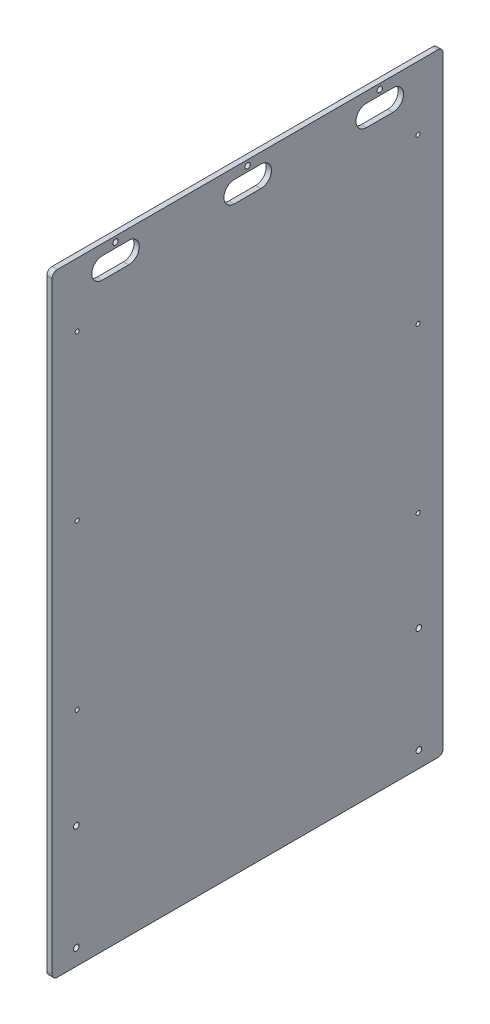
ISO-10303-21;
HEADER;
FILE_DESCRIPTION(('STEP AP214'),'2;1');
FILE_NAME('part.step','',(''),(''),'','','');
FILE_SCHEMA(('AUTOMOTIVE_DESIGN { 1 0 10303 214 1 1 1 1 }'));
ENDSEC;
DATA;
#1=APPLICATION_CONTEXT('core data for automotive mechanical design processes');
#2=APPLICATION_PROTOCOL_DEFINITION('international standard','automotive_design',2000,#1);
#3=PRODUCT_CONTEXT('',#1,'mechanical');
#4=PRODUCT('Part','Part','',(#3));
#5=PRODUCT_RELATED_PRODUCT_CATEGORY('part','',(#4));
#6=PRODUCT_DEFINITION_FORMATION('','',#4);
#7=PRODUCT_DEFINITION_CONTEXT('part definition',#1,'design');
#8=PRODUCT_DEFINITION('design','',#6,#7);
#9=PRODUCT_DEFINITION_SHAPE('','',#8);
#10=(LENGTH_UNIT() NAMED_UNIT(*) SI_UNIT(.MILLI.,.METRE.));
#11=(NAMED_UNIT(*) PLANE_ANGLE_UNIT() SI_UNIT($,.RADIAN.));
#12=(NAMED_UNIT(*) SI_UNIT($,.STERADIAN.) SOLID_ANGLE_UNIT());
#13=UNCERTAINTY_MEASURE_WITH_UNIT(LENGTH_MEASURE(1.E-05),#10,'distance_accuracy_value','');
#14=(GEOMETRIC_REPRESENTATION_CONTEXT(3) GLOBAL_UNCERTAINTY_ASSIGNED_CONTEXT((#13)) GLOBAL_UNIT_ASSIGNED_CONTEXT((#10,
#11,#12)) REPRESENTATION_CONTEXT('',''));
#15=CARTESIAN_POINT('',(0.,0.,0.));
#16=DIRECTION('',(0.,0.,1.));
#17=DIRECTION('',(1.,0.,0.));
#18=AXIS2_PLACEMENT_3D('',#15,#16,#17);
#19=CARTESIAN_POINT('',(0.,0.,0.));
#20=DIRECTION('',(-1.,0.,0.));
#21=DIRECTION('',(0.,0.,1.));
#22=AXIS2_PLACEMENT_3D('',#19,#20,#21);
#23=PLANE('',#22);
#24=CARTESIAN_POINT('',(0.,361.95,158.75));
#25=DIRECTION('',(1.,0.,0.));
#26=DIRECTION('',(0.,0.,-1.));
#27=AXIS2_PLACEMENT_3D('',#24,#25,#26);
#28=CIRCLE('',#27,3.17499999999998);
#29=CARTESIAN_POINT('',(0.,361.95,155.575));
#30=VERTEX_POINT('',#29);
#31=EDGE_CURVE('E669',#30,#30,#28,.T.);
#32=ORIENTED_EDGE('',*,*,#31,.T.);
#33=EDGE_LOOP('',(#32));
#34=FACE_BOUND('',#33,.T.);
#35=CARTESIAN_POINT('',(0.,361.95,0.));
#36=DIRECTION('',(1.,0.,0.));
#37=DIRECTION('',(0.,0.,-1.));
#38=AXIS2_PLACEMENT_3D('',#35,#36,#37);
#39=CIRCLE('',#38,3.17499999999998);
#40=CARTESIAN_POINT('',(0.,361.95,-3.17499999999998));
#41=VERTEX_POINT('',#40);
#42=EDGE_CURVE('E663',#41,#41,#39,.T.);
#43=ORIENTED_EDGE('',*,*,#42,.T.);
#44=EDGE_LOOP('',(#43));
#45=FACE_BOUND('',#44,.T.);
#46=CARTESIAN_POINT('',(0.,361.95,-158.75));
#47=DIRECTION('',(1.,0.,0.));
#48=DIRECTION('',(0.,0.,-1.));
#49=AXIS2_PLACEMENT_3D('',#46,#47,#48);
#50=CIRCLE('',#49,3.17499999999998);
#51=CARTESIAN_POINT('',(0.,361.95,-161.925));
#52=VERTEX_POINT('',#51);
#53=EDGE_CURVE('E205',#52,#52,#50,.T.);
#54=ORIENTED_EDGE('',*,*,#53,.T.);
#55=EDGE_LOOP('',(#54));
#56=FACE_BOUND('',#55,.T.);
#57=CARTESIAN_POINT('',(0.,342.9,174.625));
#58=DIRECTION('',(1.,0.,0.));
#59=DIRECTION('',(0.,0.,-1.));
#60=AXIS2_PLACEMENT_3D('',#57,#58,#59);
#61=CIRCLE('',#60,12.7);
#62=CARTESIAN_POINT('',(0.,355.6,174.625));
#63=VERTEX_POINT('',#62);
#64=CARTESIAN_POINT('',(0.,330.2,174.625));
#65=VERTEX_POINT('',#64);
#66=EDGE_CURVE('E179',#63,#65,#61,.T.);
#67=ORIENTED_EDGE('',*,*,#66,.T.);
#68=DIRECTION('',(0.,0.,-1.));
#69=VECTOR('',#68,1.);
#70=CARTESIAN_POINT('',(0.,330.2,174.625));
#71=LINE('',#70,#69);
#72=CARTESIAN_POINT('',(0.,330.2,142.875));
#73=VERTEX_POINT('',#72);
#74=EDGE_CURVE('E191',#65,#73,#71,.T.);
#75=ORIENTED_EDGE('',*,*,#74,.T.);
#76=CARTESIAN_POINT('',(0.,342.9,142.875));
#77=DIRECTION('',(1.,0.,0.));
#78=DIRECTION('',(0.,0.,-1.));
#79=AXIS2_PLACEMENT_3D('',#76,#77,#78);
#80=CIRCLE('',#79,12.7);
#81=CARTESIAN_POINT('',(0.,355.6,142.875));
#82=VERTEX_POINT('',#81);
#83=EDGE_CURVE('E195',#73,#82,#80,.T.);
#84=ORIENTED_EDGE('',*,*,#83,.T.);
#85=DIRECTION('',(0.,0.,1.));
#86=VECTOR('',#85,1.);
#87=CARTESIAN_POINT('',(0.,355.6,174.625));
#88=LINE('',#87,#86);
#89=EDGE_CURVE('E187',#82,#63,#88,.T.);
#90=ORIENTED_EDGE('',*,*,#89,.T.);
#91=EDGE_LOOP('',(#67,#75,#84,#90));
#92=FACE_BOUND('',#91,.T.);
#93=CARTESIAN_POINT('',(0.,342.9,15.8750000000001));
#94=DIRECTION('',(1.,0.,0.));
#95=DIRECTION('',(0.,0.,-1.));
#96=AXIS2_PLACEMENT_3D('',#93,#94,#95);
#97=CIRCLE('',#96,12.7);
#98=CARTESIAN_POINT('',(0.,355.6,15.8750000000001));
#99=VERTEX_POINT('',#98);
#100=CARTESIAN_POINT('',(0.,330.2,15.8750000000001));
#101=VERTEX_POINT('',#100);
#102=EDGE_CURVE('E222',#99,#101,#97,.T.);
#103=ORIENTED_EDGE('',*,*,#102,.T.);
#104=DIRECTION('',(0.,0.,-1.));
#105=VECTOR('',#104,1.);
#106=CARTESIAN_POINT('',(0.,330.2,15.8750000000001));
#107=LINE('',#106,#105);
#108=CARTESIAN_POINT('',(0.,330.2,-15.8749999999999));
#109=VERTEX_POINT('',#108);
#110=EDGE_CURVE('E225',#101,#109,#107,.T.);
#111=ORIENTED_EDGE('',*,*,#110,.T.);
#112=CARTESIAN_POINT('',(0.,342.9,-15.8749999999999));
#113=DIRECTION('',(1.,0.,0.));
#114=DIRECTION('',(0.,0.,-1.));
#115=AXIS2_PLACEMENT_3D('',#112,#113,#114);
#116=CIRCLE('',#115,12.7);
#117=CARTESIAN_POINT('',(0.,355.6,-15.8749999999999));
#118=VERTEX_POINT('',#117);
#119=EDGE_CURVE('E229',#109,#118,#116,.T.);
#120=ORIENTED_EDGE('',*,*,#119,.T.);
#121=DIRECTION('',(0.,0.,1.));
#122=VECTOR('',#121,1.);
#123=CARTESIAN_POINT('',(0.,355.6,15.8750000000001));
#124=LINE('',#123,#122);
#125=EDGE_CURVE('E232',#118,#99,#124,.T.);
#126=ORIENTED_EDGE('',*,*,#125,.T.);
#127=EDGE_LOOP('',(#103,#111,#120,#126));
#128=FACE_BOUND('',#127,.T.);
#129=CARTESIAN_POINT('',(0.,342.9,-142.875));
#130=DIRECTION('',(1.,0.,0.));
#131=DIRECTION('',(0.,0.,-1.));
#132=AXIS2_PLACEMENT_3D('',#129,#130,#131);
#133=CIRCLE('',#132,12.7);
#134=CARTESIAN_POINT('',(0.,355.6,-142.875));
#135=VERTEX_POINT('',#134);
#136=CARTESIAN_POINT('',(0.,330.2,-142.875));
#137=VERTEX_POINT('',#136);
#138=EDGE_CURVE('E254',#135,#137,#133,.T.);
#139=ORIENTED_EDGE('',*,*,#138,.T.);
#140=DIRECTION('',(0.,0.,-1.));
#141=VECTOR('',#140,1.);
#142=CARTESIAN_POINT('',(0.,330.2,-142.875));
#143=LINE('',#142,#141);
#144=CARTESIAN_POINT('',(0.,330.2,-174.625));
#145=VERTEX_POINT('',#144);
#146=EDGE_CURVE('E257',#137,#145,#143,.T.);
#147=ORIENTED_EDGE('',*,*,#146,.T.);
#148=CARTESIAN_POINT('',(0.,342.9,-174.625));
#149=DIRECTION('',(1.,0.,0.));
#150=DIRECTION('',(0.,0.,-1.));
#151=AXIS2_PLACEMENT_3D('',#148,#149,#150);
#152=CIRCLE('',#151,12.7);
#153=CARTESIAN_POINT('',(0.,355.6,-174.625));
#154=VERTEX_POINT('',#153);
#155=EDGE_CURVE('E261',#145,#154,#152,.T.);
#156=ORIENTED_EDGE('',*,*,#155,.T.);
#157=DIRECTION('',(0.,0.,1.));
#158=VECTOR('',#157,1.);
#159=CARTESIAN_POINT('',(0.,355.6,-142.875));
#160=LINE('',#159,#158);
#161=EDGE_CURVE('E264',#154,#135,#160,.T.);
#162=ORIENTED_EDGE('',*,*,#161,.T.);
#163=EDGE_LOOP('',(#139,#147,#156,#162));
#164=FACE_BOUND('',#163,.T.);
#165=CARTESIAN_POINT('',(0.,-221.996,205.74));
#166=DIRECTION('',(1.,0.,0.));
#167=DIRECTION('',(0.,0.,-1.));
#168=AXIS2_PLACEMENT_3D('',#165,#166,#167);
#169=CIRCLE('',#168,3.3782);
#170=CARTESIAN_POINT('',(0.,-221.996,202.3618));
#171=VERTEX_POINT('',#170);
#172=EDGE_CURVE('E287',#171,#171,#169,.T.);
#173=ORIENTED_EDGE('',*,*,#172,.T.);
#174=EDGE_LOOP('',(#173));
#175=FACE_BOUND('',#174,.T.);
#176=CARTESIAN_POINT('',(0.,-348.996,205.74));
#177=DIRECTION('',(1.,0.,0.));
#178=DIRECTION('',(0.,0.,-1.));
#179=AXIS2_PLACEMENT_3D('',#176,#177,#178);
#180=CIRCLE('',#179,3.3782);
#181=CARTESIAN_POINT('',(0.,-348.996,202.3618));
#182=VERTEX_POINT('',#181);
#183=EDGE_CURVE('E293',#182,#182,#180,.T.);
#184=ORIENTED_EDGE('',*,*,#183,.T.);
#185=EDGE_LOOP('',(#184));
#186=FACE_BOUND('',#185,.T.);
#187=DIRECTION('',(0.,1.,0.));
#188=VECTOR('',#187,1.);
#189=CARTESIAN_POINT('',(0.,-368.3,-234.95));
#190=LINE('',#189,#188);
#191=CARTESIAN_POINT('',(0.,-361.95,-234.95));
#192=VERTEX_POINT('',#191);
#193=CARTESIAN_POINT('',(0.,361.95,-234.95));
#194=VERTEX_POINT('',#193);
#195=EDGE_CURVE('E344',#192,#194,#190,.T.);
#196=ORIENTED_EDGE('',*,*,#195,.F.);
#197=CARTESIAN_POINT('',(0.,-361.95,-228.6));
#198=DIRECTION('',(-1.,0.,0.));
#199=DIRECTION('',(0.,0.,1.));
#200=AXIS2_PLACEMENT_3D('',#197,#198,#199);
#201=CIRCLE('',#200,6.35);
#202=CARTESIAN_POINT('',(0.,-368.3,-228.6));
#203=VERTEX_POINT('',#202);
#204=EDGE_CURVE('E376',#192,#203,#201,.T.);
#205=ORIENTED_EDGE('',*,*,#204,.T.);
#206=DIRECTION('',(0.,0.,-1.));
#207=VECTOR('',#206,1.);
#208=CARTESIAN_POINT('',(0.,-368.3,234.95));
#209=LINE('',#208,#207);
#210=CARTESIAN_POINT('',(0.,-368.3,228.6));
#211=VERTEX_POINT('',#210);
#212=EDGE_CURVE('E349',#211,#203,#209,.T.);
#213=ORIENTED_EDGE('',*,*,#212,.F.);
#214=CARTESIAN_POINT('',(0.,-361.95,228.6));
#215=DIRECTION('',(-1.,0.,0.));
#216=DIRECTION('',(0.,0.,1.));
#217=AXIS2_PLACEMENT_3D('',#214,#215,#216);
#218=CIRCLE('',#217,6.35);
#219=CARTESIAN_POINT('',(0.,-361.95,234.95));
#220=VERTEX_POINT('',#219);
#221=EDGE_CURVE('E374',#211,#220,#218,.T.);
#222=ORIENTED_EDGE('',*,*,#221,.T.);
#223=DIRECTION('',(0.,-1.,0.));
#224=VECTOR('',#223,1.);
#225=CARTESIAN_POINT('',(0.,-368.3,234.95));
#226=LINE('',#225,#224);
#227=CARTESIAN_POINT('',(0.,361.95,234.95));
#228=VERTEX_POINT('',#227);
#229=EDGE_CURVE('E362',#228,#220,#226,.T.);
#230=ORIENTED_EDGE('',*,*,#229,.F.);
#231=CARTESIAN_POINT('',(0.,361.95,228.6));
#232=DIRECTION('',(-1.,0.,0.));
#233=DIRECTION('',(0.,0.,1.));
#234=AXIS2_PLACEMENT_3D('',#231,#232,#233);
#235=CIRCLE('',#234,6.35);
#236=CARTESIAN_POINT('',(0.,368.3,228.6));
#237=VERTEX_POINT('',#236);
#238=EDGE_CURVE('E372',#228,#237,#235,.T.);
#239=ORIENTED_EDGE('',*,*,#238,.T.);
#240=DIRECTION('',(0.,0.,1.));
#241=VECTOR('',#240,1.);
#242=CARTESIAN_POINT('',(0.,368.3,234.95));
#243=LINE('',#242,#241);
#244=CARTESIAN_POINT('',(0.,368.3,-228.6));
#245=VERTEX_POINT('',#244);
#246=EDGE_CURVE('E359',#245,#237,#243,.T.);
#247=ORIENTED_EDGE('',*,*,#246,.F.);
#248=CARTESIAN_POINT('',(0.,361.95,-228.6));
#249=DIRECTION('',(-1.,0.,0.));
#250=DIRECTION('',(0.,0.,1.));
#251=AXIS2_PLACEMENT_3D('',#248,#249,#250);
#252=CIRCLE('',#251,6.35);
#253=EDGE_CURVE('E370',#245,#194,#252,.T.);
#254=ORIENTED_EDGE('',*,*,#253,.T.);
#255=EDGE_LOOP('',(#196,#205,#213,#222,#230,#239,#247,#254));
#256=FACE_BOUND('',#255,.T.);
#257=CARTESIAN_POINT('',(0.,-101.854,-204.7875));
#258=DIRECTION('',(1.,0.,0.));
#259=DIRECTION('',(0.,0.,-1.));
#260=AXIS2_PLACEMENT_3D('',#257,#258,#259);
#261=CIRCLE('',#260,2.45745);
#262=CARTESIAN_POINT('',(0.,-101.854,-207.24495));
#263=VERTEX_POINT('',#262);
#264=EDGE_CURVE('E341',#263,#263,#261,.T.);
#265=ORIENTED_EDGE('',*,*,#264,.T.);
#266=EDGE_LOOP('',(#265));
#267=FACE_BOUND('',#266,.T.);
#268=CARTESIAN_POINT('',(0.,291.846,-204.7875));
#269=DIRECTION('',(1.,0.,0.));
#270=DIRECTION('',(0.,0.,-1.));
#271=AXIS2_PLACEMENT_3D('',#268,#269,#270);
#272=CIRCLE('',#271,2.45744999999997);
#273=CARTESIAN_POINT('',(0.,291.846,-207.24495));
#274=VERTEX_POINT('',#273);
#275=EDGE_CURVE('E335',#274,#274,#272,.T.);
#276=ORIENTED_EDGE('',*,*,#275,.T.);
#277=EDGE_LOOP('',(#276));
#278=FACE_BOUND('',#277,.T.);
#279=CARTESIAN_POINT('',(0.,94.9960000000001,-204.7875));
#280=DIRECTION('',(1.,0.,0.));
#281=DIRECTION('',(0.,0.,-1.));
#282=AXIS2_PLACEMENT_3D('',#279,#280,#281);
#283=CIRCLE('',#282,2.45745);
#284=CARTESIAN_POINT('',(0.,94.9960000000001,-207.24495));
#285=VERTEX_POINT('',#284);
#286=EDGE_CURVE('E329',#285,#285,#283,.T.);
#287=ORIENTED_EDGE('',*,*,#286,.T.);
#288=EDGE_LOOP('',(#287));
#289=FACE_BOUND('',#288,.T.);
#290=CARTESIAN_POINT('',(0.,-101.854,204.7875));
#291=DIRECTION('',(1.,0.,0.));
#292=DIRECTION('',(0.,0.,-1.));
#293=AXIS2_PLACEMENT_3D('',#290,#291,#292);
#294=CIRCLE('',#293,2.45745);
#295=CARTESIAN_POINT('',(0.,-101.854,202.33005));
#296=VERTEX_POINT('',#295);
#297=EDGE_CURVE('E323',#296,#296,#294,.T.);
#298=ORIENTED_EDGE('',*,*,#297,.T.);
#299=EDGE_LOOP('',(#298));
#300=FACE_BOUND('',#299,.T.);
#301=CARTESIAN_POINT('',(0.,94.9960000000001,204.7875));
#302=DIRECTION('',(1.,0.,0.));
#303=DIRECTION('',(0.,0.,-1.));
#304=AXIS2_PLACEMENT_3D('',#301,#302,#303);
#305=CIRCLE('',#304,2.45745);
#306=CARTESIAN_POINT('',(0.,94.9960000000001,202.33005));
#307=VERTEX_POINT('',#306);
#308=EDGE_CURVE('E317',#307,#307,#305,.T.);
#309=ORIENTED_EDGE('',*,*,#308,.T.);
#310=EDGE_LOOP('',(#309));
#311=FACE_BOUND('',#310,.T.);
#312=CARTESIAN_POINT('',(0.,291.846,204.7875));
#313=DIRECTION('',(1.,0.,0.));
#314=DIRECTION('',(0.,0.,-1.));
#315=AXIS2_PLACEMENT_3D('',#312,#313,#314);
#316=CIRCLE('',#315,2.45744999999997);
#317=CARTESIAN_POINT('',(0.,291.846,202.33005));
#318=VERTEX_POINT('',#317);
#319=EDGE_CURVE('E311',#318,#318,#316,.T.);
#320=ORIENTED_EDGE('',*,*,#319,.T.);
#321=EDGE_LOOP('',(#320));
#322=FACE_BOUND('',#321,.T.);
#323=CARTESIAN_POINT('',(0.,-348.996,-205.74));
#324=DIRECTION('',(1.,0.,0.));
#325=DIRECTION('',(0.,0.,-1.));
#326=AXIS2_PLACEMENT_3D('',#323,#324,#325);
#327=CIRCLE('',#326,3.3782);
#328=CARTESIAN_POINT('',(0.,-348.996,-209.1182));
#329=VERTEX_POINT('',#328);
#330=EDGE_CURVE('E305',#329,#329,#327,.T.);
#331=ORIENTED_EDGE('',*,*,#330,.T.);
#332=EDGE_LOOP('',(#331));
#333=FACE_BOUND('',#332,.T.);
#334=CARTESIAN_POINT('',(0.,-221.996,-205.74));
#335=DIRECTION('',(1.,0.,0.));
#336=DIRECTION('',(0.,0.,-1.));
#337=AXIS2_PLACEMENT_3D('',#334,#335,#336);
#338=CIRCLE('',#337,3.3782);
#339=CARTESIAN_POINT('',(0.,-221.996,-209.1182));
#340=VERTEX_POINT('',#339);
#341=EDGE_CURVE('E299',#340,#340,#338,.T.);
#342=ORIENTED_EDGE('',*,*,#341,.T.);
#343=EDGE_LOOP('',(#342));
#344=FACE_BOUND('',#343,.T.);
#345=ADVANCED_FACE('F37',(#34,#45,#56,#92,#128,#164,#175,#186,#256,#267,#278,#289,#300,#311,
#322,#333,#344),#23,.T.);
#346=CARTESIAN_POINT('',(6.35,-368.3,-234.95));
#347=DIRECTION('',(0.,0.,1.));
#348=DIRECTION('',(1.,0.,0.));
#349=AXIS2_PLACEMENT_3D('',#346,#347,#348);
#350=PLANE('',#349);
#351=DIRECTION('',(0.,1.,0.));
#352=VECTOR('',#351,1.);
#353=CARTESIAN_POINT('',(6.35,-368.3,-234.95));
#354=LINE('',#353,#352);
#355=CARTESIAN_POINT('',(6.35,-361.95,-234.95));
#356=VERTEX_POINT('',#355);
#357=CARTESIAN_POINT('',(6.35,361.95,-234.95));
#358=VERTEX_POINT('',#357);
#359=EDGE_CURVE('E345',#356,#358,#354,.T.);
#360=ORIENTED_EDGE('',*,*,#359,.F.);
#361=DIRECTION('',(-1.,0.,0.));
#362=VECTOR('',#361,1.);
#363=CARTESIAN_POINT('',(6.35,-361.95,-234.95));
#364=LINE('',#363,#362);
#365=EDGE_CURVE('E367',#356,#192,#364,.T.);
#366=ORIENTED_EDGE('',*,*,#365,.T.);
#367=ORIENTED_EDGE('',*,*,#195,.T.);
#368=DIRECTION('',(-1.,0.,0.));
#369=VECTOR('',#368,1.);
#370=CARTESIAN_POINT('',(6.35,361.95,-234.95));
#371=LINE('',#370,#369);
#372=EDGE_CURVE('E356',#194,#358,#371,.F.);
#373=ORIENTED_EDGE('',*,*,#372,.T.);
#374=EDGE_LOOP('',(#360,#366,#367,#373));
#375=FACE_BOUND('',#374,.T.);
#376=ADVANCED_FACE('F426',(#375),#350,.F.);
#377=CARTESIAN_POINT('',(6.35,368.3,234.95));
#378=DIRECTION('',(0.,-1.,0.));
#379=DIRECTION('',(0.,0.,-1.));
#380=AXIS2_PLACEMENT_3D('',#377,#378,#379);
#381=PLANE('',#380);
#382=ORIENTED_EDGE('',*,*,#246,.T.);
#383=DIRECTION('',(-1.,0.,0.));
#384=VECTOR('',#383,1.);
#385=CARTESIAN_POINT('',(6.35,368.3,228.6));
#386=LINE('',#385,#384);
#387=CARTESIAN_POINT('',(6.35,368.3,228.6));
#388=VERTEX_POINT('',#387);
#389=EDGE_CURVE('E11',#237,#388,#386,.F.);
#390=ORIENTED_EDGE('',*,*,#389,.T.);
#391=DIRECTION('',(0.,0.,1.));
#392=VECTOR('',#391,1.);
#393=CARTESIAN_POINT('',(6.35,368.3,234.95));
#394=LINE('',#393,#392);
#395=CARTESIAN_POINT('',(6.35,368.3,-228.6));
#396=VERTEX_POINT('',#395);
#397=EDGE_CURVE('E348',#396,#388,#394,.T.);
#398=ORIENTED_EDGE('',*,*,#397,.F.);
#399=DIRECTION('',(-1.,0.,0.));
#400=VECTOR('',#399,1.);
#401=CARTESIAN_POINT('',(6.35,368.3,-228.6));
#402=LINE('',#401,#400);
#403=EDGE_CURVE('E45',#396,#245,#402,.T.);
#404=ORIENTED_EDGE('',*,*,#403,.T.);
#405=EDGE_LOOP('',(#382,#390,#398,#404));
#406=FACE_BOUND('',#405,.T.);
#407=ADVANCED_FACE('F398',(#406),#381,.F.);
#408=CARTESIAN_POINT('',(6.35,-368.3,234.95));
#409=DIRECTION('',(0.,0.,-1.));
#410=DIRECTION('',(-1.,0.,0.));
#411=AXIS2_PLACEMENT_3D('',#408,#409,#410);
#412=PLANE('',#411);
#413=ORIENTED_EDGE('',*,*,#229,.T.);
#414=DIRECTION('',(-1.,0.,0.));
#415=VECTOR('',#414,1.);
#416=CARTESIAN_POINT('',(6.35,-361.95,234.95));
#417=LINE('',#416,#415);
#418=CARTESIAN_POINT('',(6.35,-361.95,234.95));
#419=VERTEX_POINT('',#418);
#420=EDGE_CURVE('E52',#220,#419,#417,.F.);
#421=ORIENTED_EDGE('',*,*,#420,.T.);
#422=DIRECTION('',(0.,-1.,0.));
#423=VECTOR('',#422,1.);
#424=CARTESIAN_POINT('',(6.35,-368.3,234.95));
#425=LINE('',#424,#423);
#426=CARTESIAN_POINT('',(6.35,361.95,234.95));
#427=VERTEX_POINT('',#426);
#428=EDGE_CURVE('E351',#427,#419,#425,.T.);
#429=ORIENTED_EDGE('',*,*,#428,.F.);
#430=DIRECTION('',(-1.,0.,0.));
#431=VECTOR('',#430,1.);
#432=CARTESIAN_POINT('',(6.35,361.95,234.95));
#433=LINE('',#432,#431);
#434=EDGE_CURVE('E390',#427,#228,#433,.T.);
#435=ORIENTED_EDGE('',*,*,#434,.T.);
#436=EDGE_LOOP('',(#413,#421,#429,#435));
#437=FACE_BOUND('',#436,.T.);
#438=ADVANCED_FACE('F409',(#437),#412,.F.);
#439=CARTESIAN_POINT('',(6.35,-368.3,234.95));
#440=DIRECTION('',(0.,1.,0.));
#441=DIRECTION('',(0.,0.,1.));
#442=AXIS2_PLACEMENT_3D('',#439,#440,#441);
#443=PLANE('',#442);
#444=ORIENTED_EDGE('',*,*,#212,.T.);
#445=DIRECTION('',(-1.,0.,0.));
#446=VECTOR('',#445,1.);
#447=CARTESIAN_POINT('',(6.35,-368.3,-228.6));
#448=LINE('',#447,#446);
#449=CARTESIAN_POINT('',(6.35,-368.3,-228.6));
#450=VERTEX_POINT('',#449);
#451=EDGE_CURVE('E381',#203,#450,#448,.F.);
#452=ORIENTED_EDGE('',*,*,#451,.T.);
#453=DIRECTION('',(0.,0.,-1.));
#454=VECTOR('',#453,1.);
#455=CARTESIAN_POINT('',(6.35,-368.3,234.95));
#456=LINE('',#455,#454);
#457=CARTESIAN_POINT('',(6.35,-368.3,228.6));
#458=VERTEX_POINT('',#457);
#459=EDGE_CURVE('E353',#458,#450,#456,.T.);
#460=ORIENTED_EDGE('',*,*,#459,.F.);
#461=DIRECTION('',(-1.,0.,0.));
#462=VECTOR('',#461,1.);
#463=CARTESIAN_POINT('',(6.35,-368.3,228.6));
#464=LINE('',#463,#462);
#465=EDGE_CURVE('E378',#458,#211,#464,.T.);
#466=ORIENTED_EDGE('',*,*,#465,.T.);
#467=EDGE_LOOP('',(#444,#452,#460,#466));
#468=FACE_BOUND('',#467,.T.);
#469=ADVANCED_FACE('F418',(#468),#443,.F.);
#470=CARTESIAN_POINT('',(6.35,0.,0.));
#471=DIRECTION('',(-1.,0.,0.));
#472=DIRECTION('',(0.,0.,1.));
#473=AXIS2_PLACEMENT_3D('',#470,#471,#472);
#474=PLANE('',#473);
#475=CARTESIAN_POINT('',(6.35,361.95,158.75));
#476=DIRECTION('',(1.,0.,0.));
#477=DIRECTION('',(0.,0.,-1.));
#478=AXIS2_PLACEMENT_3D('',#475,#476,#477);
#479=CIRCLE('',#478,3.17499999999998);
#480=CARTESIAN_POINT('',(6.35,361.95,155.575));
#481=VERTEX_POINT('',#480);
#482=EDGE_CURVE('E622',#481,#481,#479,.T.);
#483=ORIENTED_EDGE('',*,*,#482,.F.);
#484=EDGE_LOOP('',(#483));
#485=FACE_BOUND('',#484,.T.);
#486=CARTESIAN_POINT('',(6.35,361.95,0.));
#487=DIRECTION('',(1.,0.,0.));
#488=DIRECTION('',(0.,0.,-1.));
#489=AXIS2_PLACEMENT_3D('',#486,#487,#488);
#490=CIRCLE('',#489,3.17499999999998);
#491=CARTESIAN_POINT('',(6.35,361.95,-3.17499999999998));
#492=VERTEX_POINT('',#491);
#493=EDGE_CURVE('E626',#492,#492,#490,.T.);
#494=ORIENTED_EDGE('',*,*,#493,.F.);
#495=EDGE_LOOP('',(#494));
#496=FACE_BOUND('',#495,.T.);
#497=CARTESIAN_POINT('',(6.35,361.95,-158.75));
#498=DIRECTION('',(1.,0.,0.));
#499=DIRECTION('',(0.,0.,-1.));
#500=AXIS2_PLACEMENT_3D('',#497,#498,#499);
#501=CIRCLE('',#500,3.17499999999998);
#502=CARTESIAN_POINT('',(6.35,361.95,-161.925));
#503=VERTEX_POINT('',#502);
#504=EDGE_CURVE('E630',#503,#503,#501,.T.);
#505=ORIENTED_EDGE('',*,*,#504,.F.);
#506=EDGE_LOOP('',(#505));
#507=FACE_BOUND('',#506,.T.);
#508=DIRECTION('',(0.,0.,-1.));
#509=VECTOR('',#508,1.);
#510=CARTESIAN_POINT('',(6.35,330.2,174.625));
#511=LINE('',#510,#509);
#512=CARTESIAN_POINT('',(6.35,330.2,174.625));
#513=VERTEX_POINT('',#512);
#514=CARTESIAN_POINT('',(6.35,330.2,142.875));
#515=VERTEX_POINT('',#514);
#516=EDGE_CURVE('E211',#513,#515,#511,.T.);
#517=ORIENTED_EDGE('',*,*,#516,.F.);
#518=CARTESIAN_POINT('',(6.35,342.9,174.625));
#519=DIRECTION('',(1.,0.,0.));
#520=DIRECTION('',(0.,0.,-1.));
#521=AXIS2_PLACEMENT_3D('',#518,#519,#520);
#522=CIRCLE('',#521,12.7);
#523=CARTESIAN_POINT('',(6.35,355.6,174.625));
#524=VERTEX_POINT('',#523);
#525=EDGE_CURVE('E182',#524,#513,#522,.T.);
#526=ORIENTED_EDGE('',*,*,#525,.F.);
#527=DIRECTION('',(0.,0.,1.));
#528=VECTOR('',#527,1.);
#529=CARTESIAN_POINT('',(6.35,355.6,174.625));
#530=LINE('',#529,#528);
#531=CARTESIAN_POINT('',(6.35,355.6,142.875));
#532=VERTEX_POINT('',#531);
#533=EDGE_CURVE('E199',#532,#524,#530,.T.);
#534=ORIENTED_EDGE('',*,*,#533,.F.);
#535=CARTESIAN_POINT('',(6.35,342.9,142.875));
#536=DIRECTION('',(1.,0.,0.));
#537=DIRECTION('',(0.,0.,-1.));
#538=AXIS2_PLACEMENT_3D('',#535,#536,#537);
#539=CIRCLE('',#538,12.7);
#540=EDGE_CURVE('E202',#515,#532,#539,.T.);
#541=ORIENTED_EDGE('',*,*,#540,.F.);
#542=EDGE_LOOP('',(#517,#526,#534,#541));
#543=FACE_BOUND('',#542,.T.);
#544=DIRECTION('',(0.,0.,-1.));
#545=VECTOR('',#544,1.);
#546=CARTESIAN_POINT('',(6.35,330.2,15.8750000000001));
#547=LINE('',#546,#545);
#548=CARTESIAN_POINT('',(6.35,330.2,15.8750000000001));
#549=VERTEX_POINT('',#548);
#550=CARTESIAN_POINT('',(6.35,330.2,-15.8749999999999));
#551=VERTEX_POINT('',#550);
#552=EDGE_CURVE('E238',#549,#551,#547,.T.);
#553=ORIENTED_EDGE('',*,*,#552,.F.);
#554=CARTESIAN_POINT('',(6.35,342.9,15.8750000000001));
#555=DIRECTION('',(1.,0.,0.));
#556=DIRECTION('',(0.,0.,-1.));
#557=AXIS2_PLACEMENT_3D('',#554,#555,#556);
#558=CIRCLE('',#557,12.7);
#559=CARTESIAN_POINT('',(6.35,355.6,15.8750000000001));
#560=VERTEX_POINT('',#559);
#561=EDGE_CURVE('E236',#560,#549,#558,.T.);
#562=ORIENTED_EDGE('',*,*,#561,.F.);
#563=DIRECTION('',(0.,0.,1.));
#564=VECTOR('',#563,1.);
#565=CARTESIAN_POINT('',(6.35,355.6,15.8750000000001));
#566=LINE('',#565,#564);
#567=CARTESIAN_POINT('',(6.35,355.6,-15.8749999999999));
#568=VERTEX_POINT('',#567);
#569=EDGE_CURVE('E226',#568,#560,#566,.T.);
#570=ORIENTED_EDGE('',*,*,#569,.F.);
#571=CARTESIAN_POINT('',(6.35,342.9,-15.8749999999999));
#572=DIRECTION('',(1.,0.,0.));
#573=DIRECTION('',(0.,0.,-1.));
#574=AXIS2_PLACEMENT_3D('',#571,#572,#573);
#575=CIRCLE('',#574,12.7);
#576=EDGE_CURVE('E242',#551,#568,#575,.T.);
#577=ORIENTED_EDGE('',*,*,#576,.F.);
#578=EDGE_LOOP('',(#553,#562,#570,#577));
#579=FACE_BOUND('',#578,.T.);
#580=DIRECTION('',(0.,0.,-1.));
#581=VECTOR('',#580,1.);
#582=CARTESIAN_POINT('',(6.35,330.2,-142.875));
#583=LINE('',#582,#581);
#584=CARTESIAN_POINT('',(6.35,330.2,-142.875));
#585=VERTEX_POINT('',#584);
#586=CARTESIAN_POINT('',(6.35,330.2,-174.625));
#587=VERTEX_POINT('',#586);
#588=EDGE_CURVE('E270',#585,#587,#583,.T.);
#589=ORIENTED_EDGE('',*,*,#588,.F.);
#590=CARTESIAN_POINT('',(6.35,342.9,-142.875));
#591=DIRECTION('',(1.,0.,0.));
#592=DIRECTION('',(0.,0.,-1.));
#593=AXIS2_PLACEMENT_3D('',#590,#591,#592);
#594=CIRCLE('',#593,12.7);
#595=CARTESIAN_POINT('',(6.35,355.6,-142.875));
#596=VERTEX_POINT('',#595);
#597=EDGE_CURVE('E268',#596,#585,#594,.T.);
#598=ORIENTED_EDGE('',*,*,#597,.F.);
#599=DIRECTION('',(0.,0.,1.));
#600=VECTOR('',#599,1.);
#601=CARTESIAN_POINT('',(6.35,355.6,-142.875));
#602=LINE('',#601,#600);
#603=CARTESIAN_POINT('',(6.35,355.6,-174.625));
#604=VERTEX_POINT('',#603);
#605=EDGE_CURVE('E258',#604,#596,#602,.T.);
#606=ORIENTED_EDGE('',*,*,#605,.F.);
#607=CARTESIAN_POINT('',(6.35,342.9,-174.625));
#608=DIRECTION('',(1.,0.,0.));
#609=DIRECTION('',(0.,0.,-1.));
#610=AXIS2_PLACEMENT_3D('',#607,#608,#609);
#611=CIRCLE('',#610,12.7);
#612=EDGE_CURVE('E273',#587,#604,#611,.T.);
#613=ORIENTED_EDGE('',*,*,#612,.F.);
#614=EDGE_LOOP('',(#589,#598,#606,#613));
#615=FACE_BOUND('',#614,.T.);
#616=CARTESIAN_POINT('',(6.35,-221.996,205.74));
#617=DIRECTION('',(1.,0.,0.));
#618=DIRECTION('',(0.,0.,-1.));
#619=AXIS2_PLACEMENT_3D('',#616,#617,#618);
#620=CIRCLE('',#619,3.3782);
#621=CARTESIAN_POINT('',(6.35,-221.996,202.3618));
#622=VERTEX_POINT('',#621);
#623=EDGE_CURVE('E218',#622,#622,#620,.T.);
#624=ORIENTED_EDGE('',*,*,#623,.F.);
#625=EDGE_LOOP('',(#624));
#626=FACE_BOUND('',#625,.T.);
#627=CARTESIAN_POINT('',(6.35,-348.996,205.74));
#628=DIRECTION('',(1.,0.,0.));
#629=DIRECTION('',(0.,0.,-1.));
#630=AXIS2_PLACEMENT_3D('',#627,#628,#629);
#631=CIRCLE('',#630,3.3782);
#632=CARTESIAN_POINT('',(6.35,-348.996,202.3618));
#633=VERTEX_POINT('',#632);
#634=EDGE_CURVE('E290',#633,#633,#631,.T.);
#635=ORIENTED_EDGE('',*,*,#634,.F.);
#636=EDGE_LOOP('',(#635));
#637=FACE_BOUND('',#636,.T.);
#638=CARTESIAN_POINT('',(6.35,-221.996,-205.74));
#639=DIRECTION('',(1.,0.,0.));
#640=DIRECTION('',(0.,0.,-1.));
#641=AXIS2_PLACEMENT_3D('',#638,#639,#640);
#642=CIRCLE('',#641,3.3782);
#643=CARTESIAN_POINT('',(6.35,-221.996,-209.1182));
#644=VERTEX_POINT('',#643);
#645=EDGE_CURVE('E296',#644,#644,#642,.T.);
#646=ORIENTED_EDGE('',*,*,#645,.F.);
#647=EDGE_LOOP('',(#646));
#648=FACE_BOUND('',#647,.T.);
#649=CARTESIAN_POINT('',(6.35,-348.996,-205.74));
#650=DIRECTION('',(1.,0.,0.));
#651=DIRECTION('',(0.,0.,-1.));
#652=AXIS2_PLACEMENT_3D('',#649,#650,#651);
#653=CIRCLE('',#652,3.3782);
#654=CARTESIAN_POINT('',(6.35,-348.996,-209.1182));
#655=VERTEX_POINT('',#654);
#656=EDGE_CURVE('E302',#655,#655,#653,.T.);
#657=ORIENTED_EDGE('',*,*,#656,.F.);
#658=EDGE_LOOP('',(#657));
#659=FACE_BOUND('',#658,.T.);
#660=CARTESIAN_POINT('',(6.35,291.846,204.7875));
#661=DIRECTION('',(1.,0.,0.));
#662=DIRECTION('',(0.,0.,-1.));
#663=AXIS2_PLACEMENT_3D('',#660,#661,#662);
#664=CIRCLE('',#663,2.45744999999997);
#665=CARTESIAN_POINT('',(6.35,291.846,202.33005));
#666=VERTEX_POINT('',#665);
#667=EDGE_CURVE('E308',#666,#666,#664,.T.);
#668=ORIENTED_EDGE('',*,*,#667,.F.);
#669=EDGE_LOOP('',(#668));
#670=FACE_BOUND('',#669,.T.);
#671=CARTESIAN_POINT('',(6.35,94.9960000000001,204.7875));
#672=DIRECTION('',(1.,0.,0.));
#673=DIRECTION('',(0.,0.,-1.));
#674=AXIS2_PLACEMENT_3D('',#671,#672,#673);
#675=CIRCLE('',#674,2.45744999999999);
#676=CARTESIAN_POINT('',(6.35,94.9960000000001,202.33005));
#677=VERTEX_POINT('',#676);
#678=EDGE_CURVE('E314',#677,#677,#675,.T.);
#679=ORIENTED_EDGE('',*,*,#678,.F.);
#680=EDGE_LOOP('',(#679));
#681=FACE_BOUND('',#680,.T.);
#682=CARTESIAN_POINT('',(6.35,-101.854,204.7875));
#683=DIRECTION('',(1.,0.,0.));
#684=DIRECTION('',(0.,0.,-1.));
#685=AXIS2_PLACEMENT_3D('',#682,#683,#684);
#686=CIRCLE('',#685,2.45744999999999);
#687=CARTESIAN_POINT('',(6.35,-101.854,202.33005));
#688=VERTEX_POINT('',#687);
#689=EDGE_CURVE('E320',#688,#688,#686,.T.);
#690=ORIENTED_EDGE('',*,*,#689,.F.);
#691=EDGE_LOOP('',(#690));
#692=FACE_BOUND('',#691,.T.);
#693=CARTESIAN_POINT('',(6.35,94.9960000000001,-204.7875));
#694=DIRECTION('',(1.,0.,0.));
#695=DIRECTION('',(0.,0.,-1.));
#696=AXIS2_PLACEMENT_3D('',#693,#694,#695);
#697=CIRCLE('',#696,2.45744999999999);
#698=CARTESIAN_POINT('',(6.35,94.9960000000001,-207.24495));
#699=VERTEX_POINT('',#698);
#700=EDGE_CURVE('E326',#699,#699,#697,.T.);
#701=ORIENTED_EDGE('',*,*,#700,.F.);
#702=EDGE_LOOP('',(#701));
#703=FACE_BOUND('',#702,.T.);
#704=CARTESIAN_POINT('',(6.35,291.846,-204.7875));
#705=DIRECTION('',(1.,0.,0.));
#706=DIRECTION('',(0.,0.,-1.));
#707=AXIS2_PLACEMENT_3D('',#704,#705,#706);
#708=CIRCLE('',#707,2.45744999999997);
#709=CARTESIAN_POINT('',(6.35,291.846,-207.24495));
#710=VERTEX_POINT('',#709);
#711=EDGE_CURVE('E332',#710,#710,#708,.T.);
#712=ORIENTED_EDGE('',*,*,#711,.F.);
#713=EDGE_LOOP('',(#712));
#714=FACE_BOUND('',#713,.T.);
#715=CARTESIAN_POINT('',(6.35,-101.854,-204.7875));
#716=DIRECTION('',(1.,0.,0.));
#717=DIRECTION('',(0.,0.,-1.));
#718=AXIS2_PLACEMENT_3D('',#715,#716,#717);
#719=CIRCLE('',#718,2.45744999999999);
#720=CARTESIAN_POINT('',(6.35,-101.854,-207.24495));
#721=VERTEX_POINT('',#720);
#722=EDGE_CURVE('E338',#721,#721,#719,.T.);
#723=ORIENTED_EDGE('',*,*,#722,.F.);
#724=EDGE_LOOP('',(#723));
#725=FACE_BOUND('',#724,.T.);
#726=ORIENTED_EDGE('',*,*,#459,.T.);
#727=CARTESIAN_POINT('',(6.35,-361.95,-228.6));
#728=DIRECTION('',(-1.,0.,0.));
#729=DIRECTION('',(0.,0.,1.));
#730=AXIS2_PLACEMENT_3D('',#727,#728,#729);
#731=CIRCLE('',#730,6.35);
#732=EDGE_CURVE('E388',#450,#356,#731,.F.);
#733=ORIENTED_EDGE('',*,*,#732,.T.);
#734=ORIENTED_EDGE('',*,*,#359,.T.);
#735=CARTESIAN_POINT('',(6.35,361.95,-228.6));
#736=DIRECTION('',(-1.,0.,0.));
#737=DIRECTION('',(0.,0.,1.));
#738=AXIS2_PLACEMENT_3D('',#735,#736,#737);
#739=CIRCLE('',#738,6.35);
#740=EDGE_CURVE('E383',#358,#396,#739,.F.);
#741=ORIENTED_EDGE('',*,*,#740,.T.);
#742=ORIENTED_EDGE('',*,*,#397,.T.);
#743=CARTESIAN_POINT('',(6.35,361.95,228.6));
#744=DIRECTION('',(-1.,0.,0.));
#745=DIRECTION('',(0.,0.,1.));
#746=AXIS2_PLACEMENT_3D('',#743,#744,#745);
#747=CIRCLE('',#746,6.35);
#748=EDGE_CURVE('E59',#388,#427,#747,.F.);
#749=ORIENTED_EDGE('',*,*,#748,.T.);
#750=ORIENTED_EDGE('',*,*,#428,.T.);
#751=CARTESIAN_POINT('',(6.35,-361.95,228.6));
#752=DIRECTION('',(-1.,0.,0.));
#753=DIRECTION('',(0.,0.,1.));
#754=AXIS2_PLACEMENT_3D('',#751,#752,#753);
#755=CIRCLE('',#754,6.35);
#756=EDGE_CURVE('E386',#419,#458,#755,.F.);
#757=ORIENTED_EDGE('',*,*,#756,.T.);
#758=EDGE_LOOP('',(#726,#733,#734,#741,#742,#749,#750,#757));
#759=FACE_BOUND('',#758,.T.);
#760=ADVANCED_FACE('F411',(#485,#496,#507,#543,#579,#615,#626,#637,#648,#659,#670,#681,#692,
#703,#714,#725,#759),#474,.F.);
#761=CARTESIAN_POINT('',(6.35,-101.854,-204.7875));
#762=DIRECTION('',(1.,0.,0.));
#763=DIRECTION('',(0.,0.,-1.));
#764=AXIS2_PLACEMENT_3D('',#761,#762,#763);
#765=CYLINDRICAL_SURFACE('',#764,2.45744999999999);
#766=ORIENTED_EDGE('',*,*,#264,.F.);
#767=EDGE_LOOP('',(#766));
#768=FACE_BOUND('',#767,.T.);
#769=ORIENTED_EDGE('',*,*,#722,.T.);
#770=EDGE_LOOP('',(#769));
#771=FACE_BOUND('',#770,.T.);
#772=ADVANCED_FACE('F571',(#768,#771),#765,.F.);
#773=CARTESIAN_POINT('',(6.35,291.846,-204.7875));
#774=DIRECTION('',(1.,0.,0.));
#775=DIRECTION('',(0.,0.,-1.));
#776=AXIS2_PLACEMENT_3D('',#773,#774,#775);
#777=CYLINDRICAL_SURFACE('',#776,2.45744999999997);
#778=ORIENTED_EDGE('',*,*,#275,.F.);
#779=EDGE_LOOP('',(#778));
#780=FACE_BOUND('',#779,.T.);
#781=ORIENTED_EDGE('',*,*,#711,.T.);
#782=EDGE_LOOP('',(#781));
#783=FACE_BOUND('',#782,.T.);
#784=ADVANCED_FACE('F568',(#780,#783),#777,.F.);
#785=CARTESIAN_POINT('',(6.35,94.9960000000001,-204.7875));
#786=DIRECTION('',(1.,0.,0.));
#787=DIRECTION('',(0.,0.,-1.));
#788=AXIS2_PLACEMENT_3D('',#785,#786,#787);
#789=CYLINDRICAL_SURFACE('',#788,2.45744999999999);
#790=ORIENTED_EDGE('',*,*,#286,.F.);
#791=EDGE_LOOP('',(#790));
#792=FACE_BOUND('',#791,.T.);
#793=ORIENTED_EDGE('',*,*,#700,.T.);
#794=EDGE_LOOP('',(#793));
#795=FACE_BOUND('',#794,.T.);
#796=ADVANCED_FACE('F564',(#792,#795),#789,.F.);
#797=CARTESIAN_POINT('',(6.35,-101.854,204.7875));
#798=DIRECTION('',(1.,0.,0.));
#799=DIRECTION('',(0.,0.,-1.));
#800=AXIS2_PLACEMENT_3D('',#797,#798,#799);
#801=CYLINDRICAL_SURFACE('',#800,2.45744999999999);
#802=ORIENTED_EDGE('',*,*,#297,.F.);
#803=EDGE_LOOP('',(#802));
#804=FACE_BOUND('',#803,.T.);
#805=ORIENTED_EDGE('',*,*,#689,.T.);
#806=EDGE_LOOP('',(#805));
#807=FACE_BOUND('',#806,.T.);
#808=ADVANCED_FACE('F560',(#804,#807),#801,.F.);
#809=CARTESIAN_POINT('',(6.35,94.9960000000001,204.7875));
#810=DIRECTION('',(1.,0.,0.));
#811=DIRECTION('',(0.,0.,-1.));
#812=AXIS2_PLACEMENT_3D('',#809,#810,#811);
#813=CYLINDRICAL_SURFACE('',#812,2.45744999999999);
#814=ORIENTED_EDGE('',*,*,#308,.F.);
#815=EDGE_LOOP('',(#814));
#816=FACE_BOUND('',#815,.T.);
#817=ORIENTED_EDGE('',*,*,#678,.T.);
#818=EDGE_LOOP('',(#817));
#819=FACE_BOUND('',#818,.T.);
#820=ADVANCED_FACE('F556',(#816,#819),#813,.F.);
#821=CARTESIAN_POINT('',(6.35,291.846,204.7875));
#822=DIRECTION('',(1.,0.,0.));
#823=DIRECTION('',(0.,0.,-1.));
#824=AXIS2_PLACEMENT_3D('',#821,#822,#823);
#825=CYLINDRICAL_SURFACE('',#824,2.45744999999997);
#826=ORIENTED_EDGE('',*,*,#319,.F.);
#827=EDGE_LOOP('',(#826));
#828=FACE_BOUND('',#827,.T.);
#829=ORIENTED_EDGE('',*,*,#667,.T.);
#830=EDGE_LOOP('',(#829));
#831=FACE_BOUND('',#830,.T.);
#832=ADVANCED_FACE('F552',(#828,#831),#825,.F.);
#833=CARTESIAN_POINT('',(6.35,-348.996,-205.74));
#834=DIRECTION('',(1.,0.,0.));
#835=DIRECTION('',(0.,0.,-1.));
#836=AXIS2_PLACEMENT_3D('',#833,#834,#835);
#837=CYLINDRICAL_SURFACE('',#836,3.3782);
#838=ORIENTED_EDGE('',*,*,#330,.F.);
#839=EDGE_LOOP('',(#838));
#840=FACE_BOUND('',#839,.T.);
#841=ORIENTED_EDGE('',*,*,#656,.T.);
#842=EDGE_LOOP('',(#841));
#843=FACE_BOUND('',#842,.T.);
#844=ADVANCED_FACE('F548',(#840,#843),#837,.F.);
#845=CARTESIAN_POINT('',(6.35,-221.996,-205.74));
#846=DIRECTION('',(1.,0.,0.));
#847=DIRECTION('',(0.,0.,-1.));
#848=AXIS2_PLACEMENT_3D('',#845,#846,#847);
#849=CYLINDRICAL_SURFACE('',#848,3.3782);
#850=ORIENTED_EDGE('',*,*,#341,.F.);
#851=EDGE_LOOP('',(#850));
#852=FACE_BOUND('',#851,.T.);
#853=ORIENTED_EDGE('',*,*,#645,.T.);
#854=EDGE_LOOP('',(#853));
#855=FACE_BOUND('',#854,.T.);
#856=ADVANCED_FACE('F544',(#852,#855),#849,.F.);
#857=CARTESIAN_POINT('',(6.35,-348.996,205.74));
#858=DIRECTION('',(1.,0.,0.));
#859=DIRECTION('',(0.,0.,-1.));
#860=AXIS2_PLACEMENT_3D('',#857,#858,#859);
#861=CYLINDRICAL_SURFACE('',#860,3.3782);
#862=ORIENTED_EDGE('',*,*,#183,.F.);
#863=EDGE_LOOP('',(#862));
#864=FACE_BOUND('',#863,.T.);
#865=ORIENTED_EDGE('',*,*,#634,.T.);
#866=EDGE_LOOP('',(#865));
#867=FACE_BOUND('',#866,.T.);
#868=ADVANCED_FACE('F540',(#864,#867),#861,.F.);
#869=CARTESIAN_POINT('',(6.35,-221.996,205.74));
#870=DIRECTION('',(1.,0.,0.));
#871=DIRECTION('',(0.,0.,-1.));
#872=AXIS2_PLACEMENT_3D('',#869,#870,#871);
#873=CYLINDRICAL_SURFACE('',#872,3.3782);
#874=ORIENTED_EDGE('',*,*,#172,.F.);
#875=EDGE_LOOP('',(#874));
#876=FACE_BOUND('',#875,.T.);
#877=ORIENTED_EDGE('',*,*,#623,.T.);
#878=EDGE_LOOP('',(#877));
#879=FACE_BOUND('',#878,.T.);
#880=ADVANCED_FACE('F536',(#876,#879),#873,.F.);
#881=CARTESIAN_POINT('',(0.,342.9,-142.875));
#882=DIRECTION('',(1.,0.,0.));
#883=DIRECTION('',(0.,0.,-1.));
#884=AXIS2_PLACEMENT_3D('',#881,#882,#883);
#885=CYLINDRICAL_SURFACE('',#884,12.7);
#886=ORIENTED_EDGE('',*,*,#597,.T.);
#887=DIRECTION('',(1.,0.,0.));
#888=VECTOR('',#887,1.);
#889=CARTESIAN_POINT('',(0.,330.2,-142.875));
#890=LINE('',#889,#888);
#891=EDGE_CURVE('E267',#137,#585,#890,.T.);
#892=ORIENTED_EDGE('',*,*,#891,.F.);
#893=ORIENTED_EDGE('',*,*,#138,.F.);
#894=DIRECTION('',(1.,0.,0.));
#895=VECTOR('',#894,1.);
#896=CARTESIAN_POINT('',(0.,355.6,-142.875));
#897=LINE('',#896,#895);
#898=EDGE_CURVE('E239',#135,#596,#897,.T.);
#899=ORIENTED_EDGE('',*,*,#898,.T.);
#900=EDGE_LOOP('',(#886,#892,#893,#899));
#901=FACE_BOUND('',#900,.T.);
#902=ADVANCED_FACE('F526',(#901),#885,.F.);
#903=CARTESIAN_POINT('',(0.,355.6,-142.875));
#904=DIRECTION('',(0.,1.,0.));
#905=DIRECTION('',(0.,0.,1.));
#906=AXIS2_PLACEMENT_3D('',#903,#904,#905);
#907=PLANE('',#906);
#908=ORIENTED_EDGE('',*,*,#605,.T.);
#909=ORIENTED_EDGE('',*,*,#898,.F.);
#910=ORIENTED_EDGE('',*,*,#161,.F.);
#911=DIRECTION('',(1.,0.,0.));
#912=VECTOR('',#911,1.);
#913=CARTESIAN_POINT('',(0.,355.6,-174.625));
#914=LINE('',#913,#912);
#915=EDGE_CURVE('E279',#154,#604,#914,.T.);
#916=ORIENTED_EDGE('',*,*,#915,.T.);
#917=EDGE_LOOP('',(#908,#909,#910,#916));
#918=FACE_BOUND('',#917,.T.);
#919=ADVANCED_FACE('F522',(#918),#907,.F.);
#920=CARTESIAN_POINT('',(0.,342.9,-174.625));
#921=DIRECTION('',(1.,0.,0.));
#922=DIRECTION('',(0.,0.,-1.));
#923=AXIS2_PLACEMENT_3D('',#920,#921,#922);
#924=CYLINDRICAL_SURFACE('',#923,12.7);
#925=ORIENTED_EDGE('',*,*,#612,.T.);
#926=ORIENTED_EDGE('',*,*,#915,.F.);
#927=ORIENTED_EDGE('',*,*,#155,.F.);
#928=DIRECTION('',(1.,0.,0.));
#929=VECTOR('',#928,1.);
#930=CARTESIAN_POINT('',(0.,330.2,-174.625));
#931=LINE('',#930,#929);
#932=EDGE_CURVE('E281',#145,#587,#931,.T.);
#933=ORIENTED_EDGE('',*,*,#932,.T.);
#934=EDGE_LOOP('',(#925,#926,#927,#933));
#935=FACE_BOUND('',#934,.T.);
#936=ADVANCED_FACE('F525',(#935),#924,.F.);
#937=CARTESIAN_POINT('',(0.,330.2,-142.875));
#938=DIRECTION('',(0.,-1.,0.));
#939=DIRECTION('',(0.,0.,-1.));
#940=AXIS2_PLACEMENT_3D('',#937,#938,#939);
#941=PLANE('',#940);
#942=ORIENTED_EDGE('',*,*,#588,.T.);
#943=ORIENTED_EDGE('',*,*,#932,.F.);
#944=ORIENTED_EDGE('',*,*,#146,.F.);
#945=ORIENTED_EDGE('',*,*,#891,.T.);
#946=EDGE_LOOP('',(#942,#943,#944,#945));
#947=FACE_BOUND('',#946,.T.);
#948=ADVANCED_FACE('F520',(#947),#941,.F.);
#949=CARTESIAN_POINT('',(0.,342.9,15.8750000000001));
#950=DIRECTION('',(1.,0.,0.));
#951=DIRECTION('',(0.,0.,-1.));
#952=AXIS2_PLACEMENT_3D('',#949,#950,#951);
#953=CYLINDRICAL_SURFACE('',#952,12.7);
#954=ORIENTED_EDGE('',*,*,#561,.T.);
#955=DIRECTION('',(1.,0.,0.));
#956=VECTOR('',#955,1.);
#957=CARTESIAN_POINT('',(0.,330.2,15.8750000000001));
#958=LINE('',#957,#956);
#959=EDGE_CURVE('E235',#101,#549,#958,.T.);
#960=ORIENTED_EDGE('',*,*,#959,.F.);
#961=ORIENTED_EDGE('',*,*,#102,.F.);
#962=DIRECTION('',(1.,0.,0.));
#963=VECTOR('',#962,1.);
#964=CARTESIAN_POINT('',(0.,355.6,15.8750000000001));
#965=LINE('',#964,#963);
#966=EDGE_CURVE('E212',#99,#560,#965,.T.);
#967=ORIENTED_EDGE('',*,*,#966,.T.);
#968=EDGE_LOOP('',(#954,#960,#961,#967));
#969=FACE_BOUND('',#968,.T.);
#970=ADVANCED_FACE('F510',(#969),#953,.F.);
#971=CARTESIAN_POINT('',(0.,355.6,15.8750000000001));
#972=DIRECTION('',(0.,1.,0.));
#973=DIRECTION('',(0.,0.,1.));
#974=AXIS2_PLACEMENT_3D('',#971,#972,#973);
#975=PLANE('',#974);
#976=ORIENTED_EDGE('',*,*,#569,.T.);
#977=ORIENTED_EDGE('',*,*,#966,.F.);
#978=ORIENTED_EDGE('',*,*,#125,.F.);
#979=DIRECTION('',(1.,0.,0.));
#980=VECTOR('',#979,1.);
#981=CARTESIAN_POINT('',(0.,355.6,-15.8749999999999));
#982=LINE('',#981,#980);
#983=EDGE_CURVE('E248',#118,#568,#982,.T.);
#984=ORIENTED_EDGE('',*,*,#983,.T.);
#985=EDGE_LOOP('',(#976,#977,#978,#984));
#986=FACE_BOUND('',#985,.T.);
#987=ADVANCED_FACE('F506',(#986),#975,.F.);
#988=CARTESIAN_POINT('',(0.,342.9,-15.8749999999999));
#989=DIRECTION('',(1.,0.,0.));
#990=DIRECTION('',(0.,0.,-1.));
#991=AXIS2_PLACEMENT_3D('',#988,#989,#990);
#992=CYLINDRICAL_SURFACE('',#991,12.7);
#993=ORIENTED_EDGE('',*,*,#576,.T.);
#994=ORIENTED_EDGE('',*,*,#983,.F.);
#995=ORIENTED_EDGE('',*,*,#119,.F.);
#996=DIRECTION('',(1.,0.,0.));
#997=VECTOR('',#996,1.);
#998=CARTESIAN_POINT('',(0.,330.2,-15.8749999999999));
#999=LINE('',#998,#997);
#1000=EDGE_CURVE('E250',#109,#551,#999,.T.);
#1001=ORIENTED_EDGE('',*,*,#1000,.T.);
#1002=EDGE_LOOP('',(#993,#994,#995,#1001));
#1003=FACE_BOUND('',#1002,.T.);
#1004=ADVANCED_FACE('F509',(#1003),#992,.F.);
#1005=CARTESIAN_POINT('',(0.,330.2,15.8750000000001));
#1006=DIRECTION('',(0.,-1.,0.));
#1007=DIRECTION('',(0.,0.,-1.));
#1008=AXIS2_PLACEMENT_3D('',#1005,#1006,#1007);
#1009=PLANE('',#1008);
#1010=ORIENTED_EDGE('',*,*,#552,.T.);
#1011=ORIENTED_EDGE('',*,*,#1000,.F.);
#1012=ORIENTED_EDGE('',*,*,#110,.F.);
#1013=ORIENTED_EDGE('',*,*,#959,.T.);
#1014=EDGE_LOOP('',(#1010,#1011,#1012,#1013));
#1015=FACE_BOUND('',#1014,.T.);
#1016=ADVANCED_FACE('F505',(#1015),#1009,.F.);
#1017=CARTESIAN_POINT('',(0.,342.9,174.625));
#1018=DIRECTION('',(1.,0.,0.));
#1019=DIRECTION('',(0.,0.,-1.));
#1020=AXIS2_PLACEMENT_3D('',#1017,#1018,#1019);
#1021=CYLINDRICAL_SURFACE('',#1020,12.7);
#1022=ORIENTED_EDGE('',*,*,#525,.T.);
#1023=DIRECTION('',(1.,0.,0.));
#1024=VECTOR('',#1023,1.);
#1025=CARTESIAN_POINT('',(0.,330.2,174.625));
#1026=LINE('',#1025,#1024);
#1027=EDGE_CURVE('E175',#65,#513,#1026,.T.);
#1028=ORIENTED_EDGE('',*,*,#1027,.F.);
#1029=ORIENTED_EDGE('',*,*,#66,.F.);
#1030=DIRECTION('',(1.,0.,0.));
#1031=VECTOR('',#1030,1.);
#1032=CARTESIAN_POINT('',(0.,355.6,174.625));
#1033=LINE('',#1032,#1031);
#1034=EDGE_CURVE('E216',#63,#524,#1033,.T.);
#1035=ORIENTED_EDGE('',*,*,#1034,.T.);
#1036=EDGE_LOOP('',(#1022,#1028,#1029,#1035));
#1037=FACE_BOUND('',#1036,.T.);
#1038=ADVANCED_FACE('F177',(#1037),#1021,.F.);
#1039=CARTESIAN_POINT('',(0.,355.6,174.625));
#1040=DIRECTION('',(0.,1.,0.));
#1041=DIRECTION('',(0.,0.,1.));
#1042=AXIS2_PLACEMENT_3D('',#1039,#1040,#1041);
#1043=PLANE('',#1042);
#1044=ORIENTED_EDGE('',*,*,#533,.T.);
#1045=ORIENTED_EDGE('',*,*,#1034,.F.);
#1046=ORIENTED_EDGE('',*,*,#89,.F.);
#1047=DIRECTION('',(1.,0.,0.));
#1048=VECTOR('',#1047,1.);
#1049=CARTESIAN_POINT('',(0.,355.6,142.875));
#1050=LINE('',#1049,#1048);
#1051=EDGE_CURVE('E219',#82,#532,#1050,.T.);
#1052=ORIENTED_EDGE('',*,*,#1051,.T.);
#1053=EDGE_LOOP('',(#1044,#1045,#1046,#1052));
#1054=FACE_BOUND('',#1053,.T.);
#1055=ADVANCED_FACE('F493',(#1054),#1043,.F.);
#1056=CARTESIAN_POINT('',(0.,342.9,142.875));
#1057=DIRECTION('',(1.,0.,0.));
#1058=DIRECTION('',(0.,0.,-1.));
#1059=AXIS2_PLACEMENT_3D('',#1056,#1057,#1058);
#1060=CYLINDRICAL_SURFACE('',#1059,12.7);
#1061=ORIENTED_EDGE('',*,*,#540,.T.);
#1062=ORIENTED_EDGE('',*,*,#1051,.F.);
#1063=ORIENTED_EDGE('',*,*,#83,.F.);
#1064=DIRECTION('',(1.,0.,0.));
#1065=VECTOR('',#1064,1.);
#1066=CARTESIAN_POINT('',(0.,330.2,142.875));
#1067=LINE('',#1066,#1065);
#1068=EDGE_CURVE('E186',#73,#515,#1067,.T.);
#1069=ORIENTED_EDGE('',*,*,#1068,.T.);
#1070=EDGE_LOOP('',(#1061,#1062,#1063,#1069));
#1071=FACE_BOUND('',#1070,.T.);
#1072=ADVANCED_FACE('F496',(#1071),#1060,.F.);
#1073=CARTESIAN_POINT('',(0.,330.2,174.625));
#1074=DIRECTION('',(0.,-1.,0.));
#1075=DIRECTION('',(0.,0.,-1.));
#1076=AXIS2_PLACEMENT_3D('',#1073,#1074,#1075);
#1077=PLANE('',#1076);
#1078=ORIENTED_EDGE('',*,*,#516,.T.);
#1079=ORIENTED_EDGE('',*,*,#1068,.F.);
#1080=ORIENTED_EDGE('',*,*,#74,.F.);
#1081=ORIENTED_EDGE('',*,*,#1027,.T.);
#1082=EDGE_LOOP('',(#1078,#1079,#1080,#1081));
#1083=FACE_BOUND('',#1082,.T.);
#1084=ADVANCED_FACE('F192',(#1083),#1077,.F.);
#1085=CARTESIAN_POINT('',(6.35,-361.95,-228.6));
#1086=DIRECTION('',(-1.,0.,0.));
#1087=DIRECTION('',(0.,0.,1.));
#1088=AXIS2_PLACEMENT_3D('',#1085,#1086,#1087);
#1089=CYLINDRICAL_SURFACE('',#1088,6.35);
#1090=ORIENTED_EDGE('',*,*,#732,.F.);
#1091=ORIENTED_EDGE('',*,*,#451,.F.);
#1092=ORIENTED_EDGE('',*,*,#204,.F.);
#1093=ORIENTED_EDGE('',*,*,#365,.F.);
#1094=EDGE_LOOP('',(#1090,#1091,#1092,#1093));
#1095=FACE_BOUND('',#1094,.T.);
#1096=ADVANCED_FACE('F423',(#1095),#1089,.T.);
#1097=CARTESIAN_POINT('',(6.35,-361.95,228.6));
#1098=DIRECTION('',(-1.,0.,0.));
#1099=DIRECTION('',(0.,0.,1.));
#1100=AXIS2_PLACEMENT_3D('',#1097,#1098,#1099);
#1101=CYLINDRICAL_SURFACE('',#1100,6.35);
#1102=ORIENTED_EDGE('',*,*,#756,.F.);
#1103=ORIENTED_EDGE('',*,*,#420,.F.);
#1104=ORIENTED_EDGE('',*,*,#221,.F.);
#1105=ORIENTED_EDGE('',*,*,#465,.F.);
#1106=EDGE_LOOP('',(#1102,#1103,#1104,#1105));
#1107=FACE_BOUND('',#1106,.T.);
#1108=ADVANCED_FACE('F415',(#1107),#1101,.T.);
#1109=CARTESIAN_POINT('',(6.35,361.95,228.6));
#1110=DIRECTION('',(-1.,0.,0.));
#1111=DIRECTION('',(0.,0.,1.));
#1112=AXIS2_PLACEMENT_3D('',#1109,#1110,#1111);
#1113=CYLINDRICAL_SURFACE('',#1112,6.35);
#1114=ORIENTED_EDGE('',*,*,#748,.F.);
#1115=ORIENTED_EDGE('',*,*,#389,.F.);
#1116=ORIENTED_EDGE('',*,*,#238,.F.);
#1117=ORIENTED_EDGE('',*,*,#434,.F.);
#1118=EDGE_LOOP('',(#1114,#1115,#1116,#1117));
#1119=FACE_BOUND('',#1118,.T.);
#1120=ADVANCED_FACE('F408',(#1119),#1113,.T.);
#1121=CARTESIAN_POINT('',(6.35,361.95,-228.6));
#1122=DIRECTION('',(-1.,0.,0.));
#1123=DIRECTION('',(0.,0.,1.));
#1124=AXIS2_PLACEMENT_3D('',#1121,#1122,#1123);
#1125=CYLINDRICAL_SURFACE('',#1124,6.35);
#1126=ORIENTED_EDGE('',*,*,#740,.F.);
#1127=ORIENTED_EDGE('',*,*,#372,.F.);
#1128=ORIENTED_EDGE('',*,*,#253,.F.);
#1129=ORIENTED_EDGE('',*,*,#403,.F.);
#1130=EDGE_LOOP('',(#1126,#1127,#1128,#1129));
#1131=FACE_BOUND('',#1130,.T.);
#1132=ADVANCED_FACE('F39',(#1131),#1125,.T.);
#1133=CARTESIAN_POINT('',(6.35,361.95,-158.75));
#1134=DIRECTION('',(1.,0.,0.));
#1135=DIRECTION('',(0.,0.,-1.));
#1136=AXIS2_PLACEMENT_3D('',#1133,#1134,#1135);
#1137=CYLINDRICAL_SURFACE('',#1136,3.17499999999998);
#1138=ORIENTED_EDGE('',*,*,#53,.F.);
#1139=EDGE_LOOP('',(#1138));
#1140=FACE_BOUND('',#1139,.T.);
#1141=ORIENTED_EDGE('',*,*,#504,.T.);
#1142=EDGE_LOOP('',(#1141));
#1143=FACE_BOUND('',#1142,.T.);
#1144=ADVANCED_FACE('F429',(#1140,#1143),#1137,.F.);
#1145=CARTESIAN_POINT('',(6.35,361.95,0.));
#1146=DIRECTION('',(1.,0.,0.));
#1147=DIRECTION('',(0.,0.,-1.));
#1148=AXIS2_PLACEMENT_3D('',#1145,#1146,#1147);
#1149=CYLINDRICAL_SURFACE('',#1148,3.17499999999998);
#1150=ORIENTED_EDGE('',*,*,#42,.F.);
#1151=EDGE_LOOP('',(#1150));
#1152=FACE_BOUND('',#1151,.T.);
#1153=ORIENTED_EDGE('',*,*,#493,.T.);
#1154=EDGE_LOOP('',(#1153));
#1155=FACE_BOUND('',#1154,.T.);
#1156=ADVANCED_FACE('F435',(#1152,#1155),#1149,.F.);
#1157=CARTESIAN_POINT('',(6.35,361.95,158.75));
#1158=DIRECTION('',(1.,0.,0.));
#1159=DIRECTION('',(0.,0.,-1.));
#1160=AXIS2_PLACEMENT_3D('',#1157,#1158,#1159);
#1161=CYLINDRICAL_SURFACE('',#1160,3.17499999999998);
#1162=ORIENTED_EDGE('',*,*,#31,.F.);
#1163=EDGE_LOOP('',(#1162));
#1164=FACE_BOUND('',#1163,.T.);
#1165=ORIENTED_EDGE('',*,*,#482,.T.);
#1166=EDGE_LOOP('',(#1165));
#1167=FACE_BOUND('',#1166,.T.);
#1168=ADVANCED_FACE('F480',(#1164,#1167),#1161,.F.);
#1169=CLOSED_SHELL('',(#345,#376,#407,#438,#469,#760,#772,#784,#796,#808,#820,#832,#844,#856,
#868,#880,#902,#919,#936,#948,#970,#987,#1004,#1016,#1038,#1055,#1072,#1084,#1096,#1108,#1120,
#1132,#1144,#1156,#1168));
#1170=MANIFOLD_SOLID_BREP('B2',#1169);
#1171=ADVANCED_BREP_SHAPE_REPRESENTATION('',(#18,#1170),#14);
#1172=SHAPE_DEFINITION_REPRESENTATION(#9,#1171);
ENDSEC;
END-ISO-10303-21;
